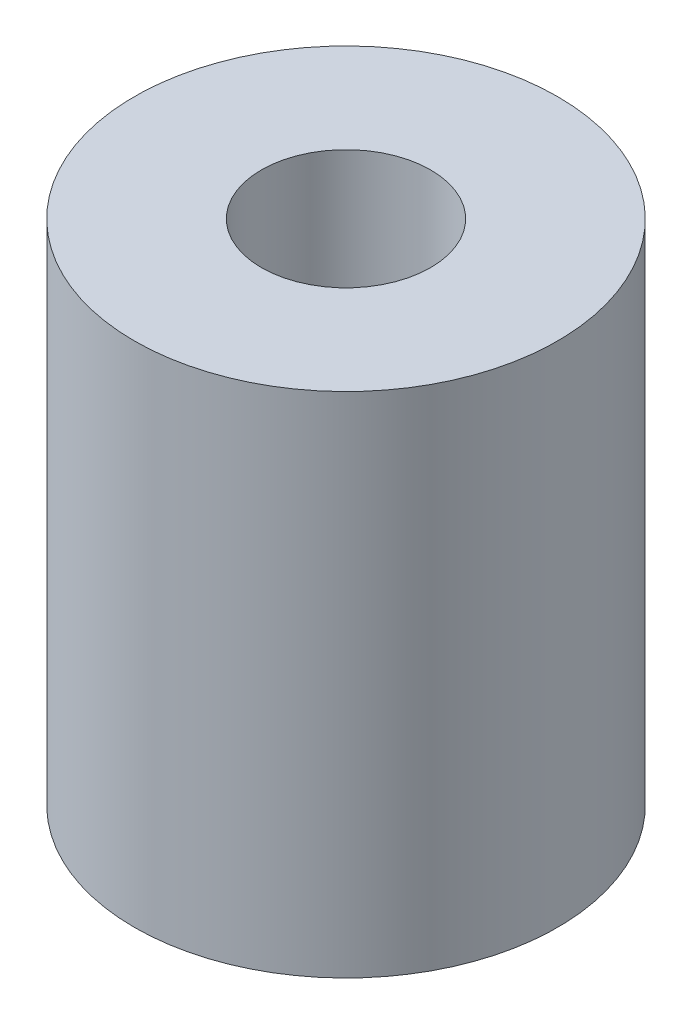
ISO-10303-21;
HEADER;
FILE_DESCRIPTION(('STEP AP214'),'2;1');
FILE_NAME('part.step','',(''),(''),'','','');
FILE_SCHEMA(('AUTOMOTIVE_DESIGN { 1 0 10303 214 1 1 1 1 }'));
ENDSEC;
DATA;
#1=APPLICATION_CONTEXT('core data for automotive mechanical design processes');
#2=APPLICATION_PROTOCOL_DEFINITION('international standard','automotive_design',2000,#1);
#3=PRODUCT_CONTEXT('',#1,'mechanical');
#4=PRODUCT('Part','Part','',(#3));
#5=PRODUCT_RELATED_PRODUCT_CATEGORY('part','',(#4));
#6=PRODUCT_DEFINITION_FORMATION('','',#4);
#7=PRODUCT_DEFINITION_CONTEXT('part definition',#1,'design');
#8=PRODUCT_DEFINITION('design','',#6,#7);
#9=PRODUCT_DEFINITION_SHAPE('','',#8);
#10=(LENGTH_UNIT() NAMED_UNIT(*) SI_UNIT(.MILLI.,.METRE.));
#11=(NAMED_UNIT(*) PLANE_ANGLE_UNIT() SI_UNIT($,.RADIAN.));
#12=(NAMED_UNIT(*) SI_UNIT($,.STERADIAN.) SOLID_ANGLE_UNIT());
#13=UNCERTAINTY_MEASURE_WITH_UNIT(LENGTH_MEASURE(1.E-05),#10,'distance_accuracy_value','');
#14=(GEOMETRIC_REPRESENTATION_CONTEXT(3) GLOBAL_UNCERTAINTY_ASSIGNED_CONTEXT((#13)) GLOBAL_UNIT_ASSIGNED_CONTEXT((#10,
#11,#12)) REPRESENTATION_CONTEXT('',''));
#15=CARTESIAN_POINT('',(0.,0.,0.));
#16=DIRECTION('',(0.,0.,1.));
#17=DIRECTION('',(1.,0.,0.));
#18=AXIS2_PLACEMENT_3D('',#15,#16,#17);
#19=CARTESIAN_POINT('',(0.,6.,0.));
#20=DIRECTION('',(0.,1.,0.));
#21=DIRECTION('',(0.,0.,1.));
#22=AXIS2_PLACEMENT_3D('',#19,#20,#21);
#23=PLANE('',#22);
#24=CARTESIAN_POINT('',(0.,6.,0.));
#25=DIRECTION('',(0.,1.,0.));
#26=DIRECTION('',(0.,0.,1.));
#27=AXIS2_PLACEMENT_3D('',#24,#25,#26);
#28=CIRCLE('',#27,2.5);
#29=CARTESIAN_POINT('',(0.,6.,2.5));
#30=VERTEX_POINT('',#29);
#31=EDGE_CURVE('E10',#30,#30,#28,.T.);
#32=ORIENTED_EDGE('',*,*,#31,.T.);
#33=EDGE_LOOP('',(#32));
#34=FACE_BOUND('',#33,.T.);
#35=CARTESIAN_POINT('',(0.,6.,0.));
#36=DIRECTION('',(0.,1.,0.));
#37=DIRECTION('',(0.,0.,1.));
#38=AXIS2_PLACEMENT_3D('',#35,#36,#37);
#39=CIRCLE('',#38,1.);
#40=CARTESIAN_POINT('',(0.,6.,1.));
#41=VERTEX_POINT('',#40);
#42=EDGE_CURVE('E50',#41,#41,#39,.T.);
#43=ORIENTED_EDGE('',*,*,#42,.F.);
#44=EDGE_LOOP('',(#43));
#45=FACE_BOUND('',#44,.T.);
#46=ADVANCED_FACE('F39',(#34,#45),#23,.T.);
#47=CARTESIAN_POINT('',(0.,0.,0.));
#48=DIRECTION('',(0.,1.,0.));
#49=DIRECTION('',(0.,0.,1.));
#50=AXIS2_PLACEMENT_3D('',#47,#48,#49);
#51=PLANE('',#50);
#52=CARTESIAN_POINT('',(0.,0.,0.));
#53=DIRECTION('',(0.,1.,0.));
#54=DIRECTION('',(0.,0.,1.));
#55=AXIS2_PLACEMENT_3D('',#52,#53,#54);
#56=CIRCLE('',#55,2.5);
#57=CARTESIAN_POINT('',(0.,0.,2.5));
#58=VERTEX_POINT('',#57);
#59=EDGE_CURVE('E43',#58,#58,#56,.T.);
#60=ORIENTED_EDGE('',*,*,#59,.F.);
#61=EDGE_LOOP('',(#60));
#62=FACE_BOUND('',#61,.T.);
#63=CARTESIAN_POINT('',(0.,0.,0.));
#64=DIRECTION('',(0.,1.,0.));
#65=DIRECTION('',(0.,0.,1.));
#66=AXIS2_PLACEMENT_3D('',#63,#64,#65);
#67=CIRCLE('',#66,1.);
#68=CARTESIAN_POINT('',(0.,0.,1.));
#69=VERTEX_POINT('',#68);
#70=EDGE_CURVE('E52',#69,#69,#67,.T.);
#71=ORIENTED_EDGE('',*,*,#70,.T.);
#72=EDGE_LOOP('',(#71));
#73=FACE_BOUND('',#72,.T.);
#74=ADVANCED_FACE('F62',(#62,#73),#51,.F.);
#75=CARTESIAN_POINT('',(0.,6.,0.));
#76=DIRECTION('',(0.,-1.,0.));
#77=DIRECTION('',(0.,0.,-1.));
#78=AXIS2_PLACEMENT_3D('',#75,#76,#77);
#79=CYLINDRICAL_SURFACE('',#78,2.5);
#80=ORIENTED_EDGE('',*,*,#31,.F.);
#81=EDGE_LOOP('',(#80));
#82=FACE_BOUND('',#81,.T.);
#83=ORIENTED_EDGE('',*,*,#59,.T.);
#84=EDGE_LOOP('',(#83));
#85=FACE_BOUND('',#84,.T.);
#86=ADVANCED_FACE('F41',(#82,#85),#79,.T.);
#87=CARTESIAN_POINT('',(0.,6.,0.));
#88=DIRECTION('',(0.,-1.,0.));
#89=DIRECTION('',(0.,0.,-1.));
#90=AXIS2_PLACEMENT_3D('',#87,#88,#89);
#91=CYLINDRICAL_SURFACE('',#90,1.);
#92=ORIENTED_EDGE('',*,*,#42,.T.);
#93=EDGE_LOOP('',(#92));
#94=FACE_BOUND('',#93,.T.);
#95=ORIENTED_EDGE('',*,*,#70,.F.);
#96=EDGE_LOOP('',(#95));
#97=FACE_BOUND('',#96,.T.);
#98=ADVANCED_FACE('F58',(#94,#97),#91,.F.);
#99=CLOSED_SHELL('',(#46,#74,#86,#98));
#100=MANIFOLD_SOLID_BREP('B2',#99);
#101=ADVANCED_BREP_SHAPE_REPRESENTATION('',(#18,#100),#14);
#102=SHAPE_DEFINITION_REPRESENTATION(#9,#101);
ENDSEC;
END-ISO-10303-21;
